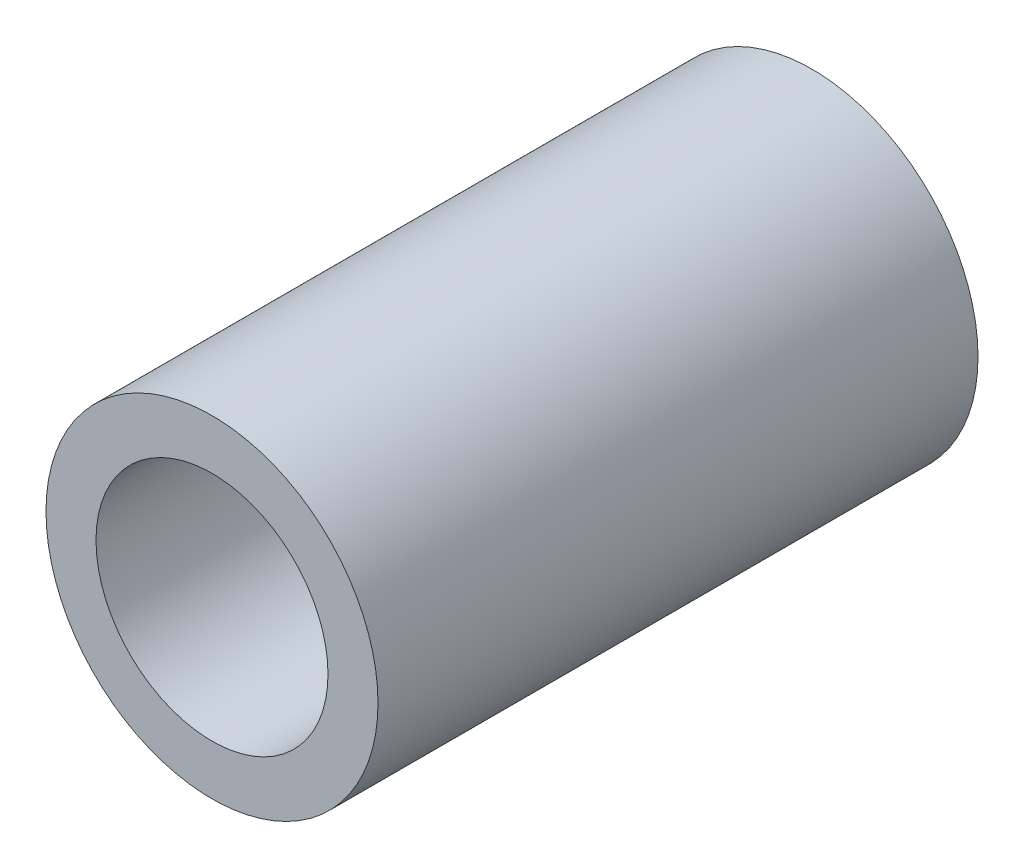
ISO-10303-21;
HEADER;
FILE_DESCRIPTION(('STEP AP214'),'2;1');
FILE_NAME('part.step','',(''),(''),'','','');
FILE_SCHEMA(('AUTOMOTIVE_DESIGN { 1 0 10303 214 1 1 1 1 }'));
ENDSEC;
DATA;
#1=APPLICATION_CONTEXT('core data for automotive mechanical design processes');
#2=APPLICATION_PROTOCOL_DEFINITION('international standard','automotive_design',2000,#1);
#3=PRODUCT_CONTEXT('',#1,'mechanical');
#4=PRODUCT('Part','Part','',(#3));
#5=PRODUCT_RELATED_PRODUCT_CATEGORY('part','',(#4));
#6=PRODUCT_DEFINITION_FORMATION('','',#4);
#7=PRODUCT_DEFINITION_CONTEXT('part definition',#1,'design');
#8=PRODUCT_DEFINITION('design','',#6,#7);
#9=PRODUCT_DEFINITION_SHAPE('','',#8);
#10=(LENGTH_UNIT() NAMED_UNIT(*) SI_UNIT(.MILLI.,.METRE.));
#11=(NAMED_UNIT(*) PLANE_ANGLE_UNIT() SI_UNIT($,.RADIAN.));
#12=(NAMED_UNIT(*) SI_UNIT($,.STERADIAN.) SOLID_ANGLE_UNIT());
#13=UNCERTAINTY_MEASURE_WITH_UNIT(LENGTH_MEASURE(1.E-05),#10,'distance_accuracy_value','');
#14=(GEOMETRIC_REPRESENTATION_CONTEXT(3) GLOBAL_UNCERTAINTY_ASSIGNED_CONTEXT((#13)) GLOBAL_UNIT_ASSIGNED_CONTEXT((#10,
#11,#12)) REPRESENTATION_CONTEXT('',''));
#15=CARTESIAN_POINT('',(0.,0.,0.));
#16=DIRECTION('',(0.,0.,1.));
#17=DIRECTION('',(1.,0.,0.));
#18=AXIS2_PLACEMENT_3D('',#15,#16,#17);
#19=CARTESIAN_POINT('',(0.,0.,38.1));
#20=DIRECTION('',(0.,0.,1.));
#21=DIRECTION('',(1.,0.,0.));
#22=AXIS2_PLACEMENT_3D('',#19,#20,#21);
#23=PLANE('',#22);
#24=CARTESIAN_POINT('',(0.,0.,38.1));
#25=DIRECTION('',(0.,0.,1.));
#26=DIRECTION('',(1.,0.,0.));
#27=AXIS2_PLACEMENT_3D('',#24,#25,#26);
#28=CIRCLE('',#27,10.541);
#29=CARTESIAN_POINT('',(10.541,0.,38.1));
#30=VERTEX_POINT('',#29);
#31=EDGE_CURVE('E10',#30,#30,#28,.T.);
#32=ORIENTED_EDGE('',*,*,#31,.T.);
#33=EDGE_LOOP('',(#32));
#34=FACE_BOUND('',#33,.T.);
#35=CARTESIAN_POINT('',(0.,0.,38.1));
#36=DIRECTION('',(0.,0.,1.));
#37=DIRECTION('',(1.,0.,0.));
#38=AXIS2_PLACEMENT_3D('',#35,#36,#37);
#39=CIRCLE('',#38,7.366);
#40=CARTESIAN_POINT('',(7.366,0.,38.1));
#41=VERTEX_POINT('',#40);
#42=EDGE_CURVE('E48',#41,#41,#39,.T.);
#43=ORIENTED_EDGE('',*,*,#42,.F.);
#44=EDGE_LOOP('',(#43));
#45=FACE_BOUND('',#44,.T.);
#46=ADVANCED_FACE('F34',(#34,#45),#23,.T.);
#47=CARTESIAN_POINT('',(0.,0.,0.));
#48=DIRECTION('',(0.,0.,1.));
#49=DIRECTION('',(1.,0.,0.));
#50=AXIS2_PLACEMENT_3D('',#47,#48,#49);
#51=PLANE('',#50);
#52=CARTESIAN_POINT('',(0.,0.,0.));
#53=DIRECTION('',(0.,0.,1.));
#54=DIRECTION('',(1.,0.,0.));
#55=AXIS2_PLACEMENT_3D('',#52,#53,#54);
#56=CIRCLE('',#55,10.541);
#57=CARTESIAN_POINT('',(10.541,0.,0.));
#58=VERTEX_POINT('',#57);
#59=EDGE_CURVE('E38',#58,#58,#56,.T.);
#60=ORIENTED_EDGE('',*,*,#59,.F.);
#61=EDGE_LOOP('',(#60));
#62=FACE_BOUND('',#61,.T.);
#63=CARTESIAN_POINT('',(0.,0.,0.));
#64=DIRECTION('',(0.,0.,1.));
#65=DIRECTION('',(1.,0.,0.));
#66=AXIS2_PLACEMENT_3D('',#63,#64,#65);
#67=CIRCLE('',#66,7.366);
#68=CARTESIAN_POINT('',(7.366,0.,0.));
#69=VERTEX_POINT('',#68);
#70=EDGE_CURVE('E50',#69,#69,#67,.T.);
#71=ORIENTED_EDGE('',*,*,#70,.T.);
#72=EDGE_LOOP('',(#71));
#73=FACE_BOUND('',#72,.T.);
#74=ADVANCED_FACE('F61',(#62,#73),#51,.F.);
#75=CARTESIAN_POINT('',(0.,0.,38.1));
#76=DIRECTION('',(0.,0.,-1.));
#77=DIRECTION('',(-1.,0.,0.));
#78=AXIS2_PLACEMENT_3D('',#75,#76,#77);
#79=CYLINDRICAL_SURFACE('',#78,10.541);
#80=ORIENTED_EDGE('',*,*,#31,.F.);
#81=EDGE_LOOP('',(#80));
#82=FACE_BOUND('',#81,.T.);
#83=ORIENTED_EDGE('',*,*,#59,.T.);
#84=EDGE_LOOP('',(#83));
#85=FACE_BOUND('',#84,.T.);
#86=ADVANCED_FACE('F36',(#82,#85),#79,.T.);
#87=CARTESIAN_POINT('',(0.,0.,38.1));
#88=DIRECTION('',(0.,0.,-1.));
#89=DIRECTION('',(-1.,0.,0.));
#90=AXIS2_PLACEMENT_3D('',#87,#88,#89);
#91=CYLINDRICAL_SURFACE('',#90,7.366);
#92=ORIENTED_EDGE('',*,*,#42,.T.);
#93=EDGE_LOOP('',(#92));
#94=FACE_BOUND('',#93,.T.);
#95=ORIENTED_EDGE('',*,*,#70,.F.);
#96=EDGE_LOOP('',(#95));
#97=FACE_BOUND('',#96,.T.);
#98=ADVANCED_FACE('F57',(#94,#97),#91,.F.);
#99=CLOSED_SHELL('',(#46,#74,#86,#98));
#100=MANIFOLD_SOLID_BREP('B2',#99);
#101=ADVANCED_BREP_SHAPE_REPRESENTATION('',(#18,#100),#14);
#102=SHAPE_DEFINITION_REPRESENTATION(#9,#101);
ENDSEC;
END-ISO-10303-21;
